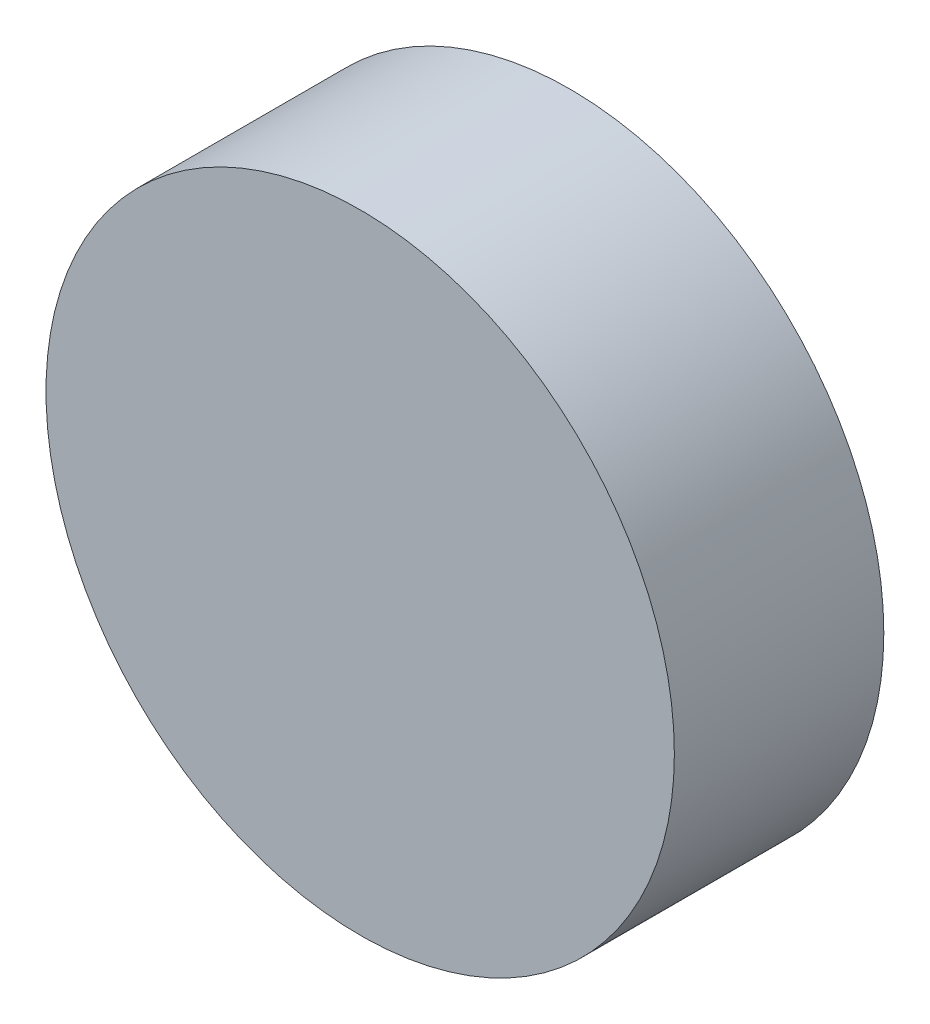
ISO-10303-21;
HEADER;
FILE_DESCRIPTION(('STEP AP214'),'2;1');
FILE_NAME('part.step','',(''),(''),'','','');
FILE_SCHEMA(('AUTOMOTIVE_DESIGN { 1 0 10303 214 1 1 1 1 }'));
ENDSEC;
DATA;
#1=APPLICATION_CONTEXT('core data for automotive mechanical design processes');
#2=APPLICATION_PROTOCOL_DEFINITION('international standard','automotive_design',2000,#1);
#3=PRODUCT_CONTEXT('',#1,'mechanical');
#4=PRODUCT('Part','Part','',(#3));
#5=PRODUCT_RELATED_PRODUCT_CATEGORY('part','',(#4));
#6=PRODUCT_DEFINITION_FORMATION('','',#4);
#7=PRODUCT_DEFINITION_CONTEXT('part definition',#1,'design');
#8=PRODUCT_DEFINITION('design','',#6,#7);
#9=PRODUCT_DEFINITION_SHAPE('','',#8);
#10=(LENGTH_UNIT() NAMED_UNIT(*) SI_UNIT(.MILLI.,.METRE.));
#11=(NAMED_UNIT(*) PLANE_ANGLE_UNIT() SI_UNIT($,.RADIAN.));
#12=(NAMED_UNIT(*) SI_UNIT($,.STERADIAN.) SOLID_ANGLE_UNIT());
#13=UNCERTAINTY_MEASURE_WITH_UNIT(LENGTH_MEASURE(1.E-05),#10,'distance_accuracy_value','');
#14=(GEOMETRIC_REPRESENTATION_CONTEXT(3) GLOBAL_UNCERTAINTY_ASSIGNED_CONTEXT((#13)) GLOBAL_UNIT_ASSIGNED_CONTEXT((#10,
#11,#12)) REPRESENTATION_CONTEXT('',''));
#15=CARTESIAN_POINT('',(0.,0.,0.));
#16=DIRECTION('',(0.,0.,1.));
#17=DIRECTION('',(1.,0.,0.));
#18=AXIS2_PLACEMENT_3D('',#15,#16,#17);
#19=CARTESIAN_POINT('',(0.,0.,10.));
#20=DIRECTION('',(0.,0.,-1.));
#21=DIRECTION('',(-1.,0.,0.));
#22=AXIS2_PLACEMENT_3D('',#19,#20,#21);
#23=CYLINDRICAL_SURFACE('',#22,15.);
#24=CARTESIAN_POINT('',(0.,0.,10.));
#25=DIRECTION('',(0.,0.,1.));
#26=DIRECTION('',(1.,0.,0.));
#27=AXIS2_PLACEMENT_3D('',#24,#25,#26);
#28=CIRCLE('',#27,15.);
#29=CARTESIAN_POINT('',(15.,0.,10.));
#30=VERTEX_POINT('',#29);
#31=EDGE_CURVE('E10',#30,#30,#28,.T.);
#32=ORIENTED_EDGE('',*,*,#31,.F.);
#33=EDGE_LOOP('',(#32));
#34=FACE_BOUND('',#33,.T.);
#35=CARTESIAN_POINT('',(0.,0.,0.));
#36=DIRECTION('',(0.,0.,1.));
#37=DIRECTION('',(1.,0.,0.));
#38=AXIS2_PLACEMENT_3D('',#35,#36,#37);
#39=CIRCLE('',#38,15.);
#40=CARTESIAN_POINT('',(15.,0.,0.));
#41=VERTEX_POINT('',#40);
#42=EDGE_CURVE('E40',#41,#41,#39,.T.);
#43=ORIENTED_EDGE('',*,*,#42,.T.);
#44=EDGE_LOOP('',(#43));
#45=FACE_BOUND('',#44,.T.);
#46=ADVANCED_FACE('F37',(#34,#45),#23,.T.);
#47=CARTESIAN_POINT('',(0.,0.,10.));
#48=DIRECTION('',(0.,0.,1.));
#49=DIRECTION('',(1.,0.,0.));
#50=AXIS2_PLACEMENT_3D('',#47,#48,#49);
#51=PLANE('',#50);
#52=ORIENTED_EDGE('',*,*,#31,.T.);
#53=EDGE_LOOP('',(#52));
#54=FACE_BOUND('',#53,.T.);
#55=ADVANCED_FACE('F54',(#54),#51,.T.);
#56=CARTESIAN_POINT('',(0.,0.,0.));
#57=DIRECTION('',(0.,0.,1.));
#58=DIRECTION('',(1.,0.,0.));
#59=AXIS2_PLACEMENT_3D('',#56,#57,#58);
#60=PLANE('',#59);
#61=ORIENTED_EDGE('',*,*,#42,.F.);
#62=EDGE_LOOP('',(#61));
#63=FACE_BOUND('',#62,.T.);
#64=ADVANCED_FACE('F52',(#63),#60,.F.);
#65=CLOSED_SHELL('',(#46,#55,#64));
#66=MANIFOLD_SOLID_BREP('B2',#65);
#67=ADVANCED_BREP_SHAPE_REPRESENTATION('',(#18,#66),#14);
#68=SHAPE_DEFINITION_REPRESENTATION(#9,#67);
ENDSEC;
END-ISO-10303-21;
